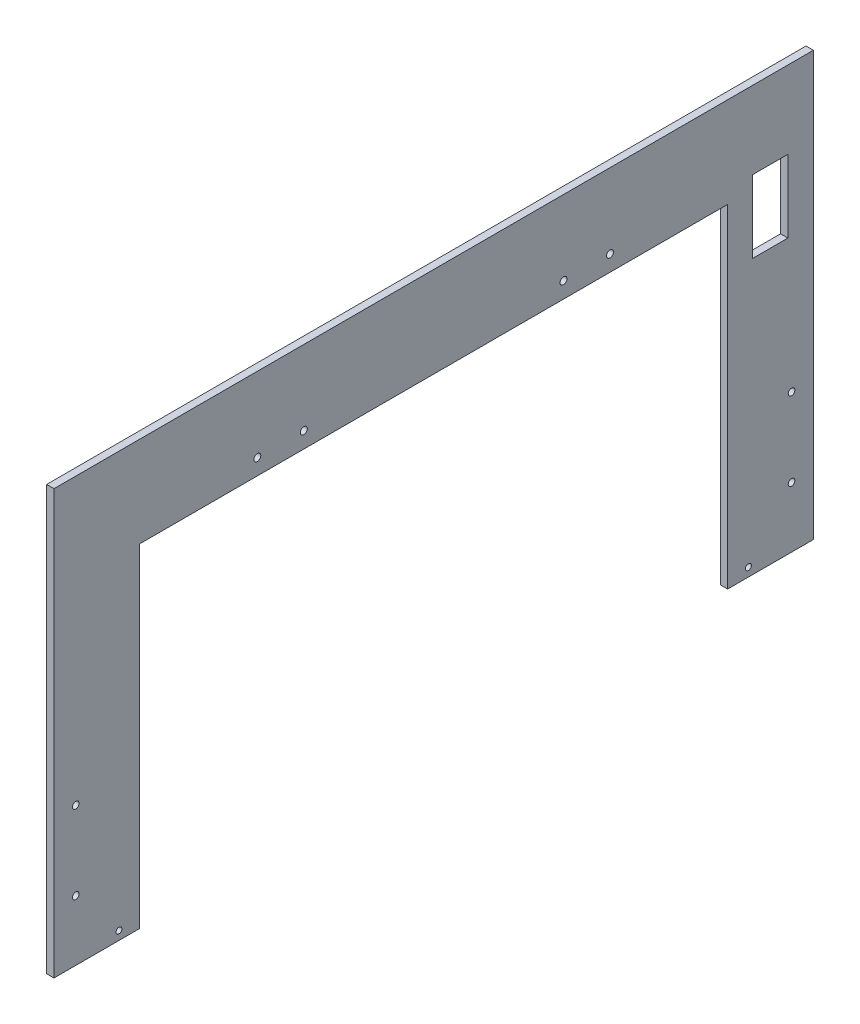
ISO-10303-21;
HEADER;
FILE_DESCRIPTION(('STEP AP214'),'2;1');
FILE_NAME('part.step','',(''),(''),'','','');
FILE_SCHEMA(('AUTOMOTIVE_DESIGN { 1 0 10303 214 1 1 1 1 }'));
ENDSEC;
DATA;
#1=APPLICATION_CONTEXT('core data for automotive mechanical design processes');
#2=APPLICATION_PROTOCOL_DEFINITION('international standard','automotive_design',2000,#1);
#3=PRODUCT_CONTEXT('',#1,'mechanical');
#4=PRODUCT('Part','Part','',(#3));
#5=PRODUCT_RELATED_PRODUCT_CATEGORY('part','',(#4));
#6=PRODUCT_DEFINITION_FORMATION('','',#4);
#7=PRODUCT_DEFINITION_CONTEXT('part definition',#1,'design');
#8=PRODUCT_DEFINITION('design','',#6,#7);
#9=PRODUCT_DEFINITION_SHAPE('','',#8);
#10=(LENGTH_UNIT() NAMED_UNIT(*) SI_UNIT(.MILLI.,.METRE.));
#11=(NAMED_UNIT(*) PLANE_ANGLE_UNIT() SI_UNIT($,.RADIAN.));
#12=(NAMED_UNIT(*) SI_UNIT($,.STERADIAN.) SOLID_ANGLE_UNIT());
#13=UNCERTAINTY_MEASURE_WITH_UNIT(LENGTH_MEASURE(1.E-05),#10,'distance_accuracy_value','');
#14=(GEOMETRIC_REPRESENTATION_CONTEXT(3) GLOBAL_UNCERTAINTY_ASSIGNED_CONTEXT((#13)) GLOBAL_UNIT_ASSIGNED_CONTEXT((#10,
#11,#12)) REPRESENTATION_CONTEXT('',''));
#15=CARTESIAN_POINT('',(0.,0.,0.));
#16=DIRECTION('',(0.,0.,1.));
#17=DIRECTION('',(1.,0.,0.));
#18=AXIS2_PLACEMENT_3D('',#15,#16,#17);
#19=CARTESIAN_POINT('',(4.7625,-137.31875,246.0625));
#20=DIRECTION('',(0.,1.,0.));
#21=DIRECTION('',(0.,0.,1.));
#22=AXIS2_PLACEMENT_3D('',#19,#20,#21);
#23=PLANE('',#22);
#24=DIRECTION('',(0.,0.,-1.));
#25=VECTOR('',#24,1.);
#26=CARTESIAN_POINT('',(0.,-137.31875,246.0625));
#27=LINE('',#26,#25);
#28=CARTESIAN_POINT('',(0.,-137.31875,246.0625));
#29=VERTEX_POINT('',#28);
#30=CARTESIAN_POINT('',(0.,-137.31875,190.5));
#31=VERTEX_POINT('',#30);
#32=EDGE_CURVE('E234',#29,#31,#27,.T.);
#33=ORIENTED_EDGE('',*,*,#32,.T.);
#34=DIRECTION('',(1.,0.,0.));
#35=VECTOR('',#34,1.);
#36=CARTESIAN_POINT('',(0.,-137.31875,190.5));
#37=LINE('',#36,#35);
#38=CARTESIAN_POINT('',(4.7625,-137.31875,190.5));
#39=VERTEX_POINT('',#38);
#40=EDGE_CURVE('E194',#31,#39,#37,.T.);
#41=ORIENTED_EDGE('',*,*,#40,.T.);
#42=DIRECTION('',(0.,0.,-1.));
#43=VECTOR('',#42,1.);
#44=CARTESIAN_POINT('',(4.7625,-137.31875,246.0625));
#45=LINE('',#44,#43);
#46=CARTESIAN_POINT('',(4.7625,-137.31875,246.0625));
#47=VERTEX_POINT('',#46);
#48=EDGE_CURVE('E239',#47,#39,#45,.T.);
#49=ORIENTED_EDGE('',*,*,#48,.F.);
#50=DIRECTION('',(-1.,0.,0.));
#51=VECTOR('',#50,1.);
#52=CARTESIAN_POINT('',(4.7625,-137.31875,246.0625));
#53=LINE('',#52,#51);
#54=EDGE_CURVE('E254',#47,#29,#53,.T.);
#55=ORIENTED_EDGE('',*,*,#54,.T.);
#56=EDGE_LOOP('',(#33,#41,#49,#55));
#57=FACE_BOUND('',#56,.T.);
#58=ADVANCED_FACE('F33',(#57),#23,.F.);
#59=CARTESIAN_POINT('',(4.7625,-137.31875,-246.0625));
#60=DIRECTION('',(0.,0.,1.));
#61=DIRECTION('',(1.,0.,0.));
#62=AXIS2_PLACEMENT_3D('',#59,#60,#61);
#63=PLANE('',#62);
#64=DIRECTION('',(0.,1.,0.));
#65=VECTOR('',#64,1.);
#66=CARTESIAN_POINT('',(0.,-137.31875,-246.0625));
#67=LINE('',#66,#65);
#68=CARTESIAN_POINT('',(0.,-137.31875,-246.0625));
#69=VERTEX_POINT('',#68);
#70=CARTESIAN_POINT('',(0.,137.31875,-246.0625));
#71=VERTEX_POINT('',#70);
#72=EDGE_CURVE('E229',#69,#71,#67,.T.);
#73=ORIENTED_EDGE('',*,*,#72,.T.);
#74=DIRECTION('',(-1.,0.,0.));
#75=VECTOR('',#74,1.);
#76=CARTESIAN_POINT('',(4.7625,137.31875,-246.0625));
#77=LINE('',#76,#75);
#78=CARTESIAN_POINT('',(4.7625,137.31875,-246.0625));
#79=VERTEX_POINT('',#78);
#80=EDGE_CURVE('E260',#79,#71,#77,.T.);
#81=ORIENTED_EDGE('',*,*,#80,.F.);
#82=DIRECTION('',(0.,1.,0.));
#83=VECTOR('',#82,1.);
#84=CARTESIAN_POINT('',(4.7625,-137.31875,-246.0625));
#85=LINE('',#84,#83);
#86=CARTESIAN_POINT('',(4.7625,-137.31875,-246.0625));
#87=VERTEX_POINT('',#86);
#88=EDGE_CURVE('E230',#87,#79,#85,.T.);
#89=ORIENTED_EDGE('',*,*,#88,.F.);
#90=DIRECTION('',(-1.,0.,0.));
#91=VECTOR('',#90,1.);
#92=CARTESIAN_POINT('',(4.7625,-137.31875,-246.0625));
#93=LINE('',#92,#91);
#94=EDGE_CURVE('E242',#87,#69,#93,.T.);
#95=ORIENTED_EDGE('',*,*,#94,.T.);
#96=EDGE_LOOP('',(#73,#81,#89,#95));
#97=FACE_BOUND('',#96,.T.);
#98=ADVANCED_FACE('F35',(#97),#63,.F.);
#99=CARTESIAN_POINT('',(4.7625,137.31875,246.0625));
#100=DIRECTION('',(0.,-1.,0.));
#101=DIRECTION('',(0.,0.,-1.));
#102=AXIS2_PLACEMENT_3D('',#99,#100,#101);
#103=PLANE('',#102);
#104=DIRECTION('',(0.,0.,1.));
#105=VECTOR('',#104,1.);
#106=CARTESIAN_POINT('',(0.,137.31875,246.0625));
#107=LINE('',#106,#105);
#108=CARTESIAN_POINT('',(0.,137.31875,246.0625));
#109=VERTEX_POINT('',#108);
#110=EDGE_CURVE('E245',#71,#109,#107,.T.);
#111=ORIENTED_EDGE('',*,*,#110,.T.);
#112=DIRECTION('',(-1.,0.,0.));
#113=VECTOR('',#112,1.);
#114=CARTESIAN_POINT('',(4.7625,137.31875,246.0625));
#115=LINE('',#114,#113);
#116=CARTESIAN_POINT('',(4.7625,137.31875,246.0625));
#117=VERTEX_POINT('',#116);
#118=EDGE_CURVE('E257',#117,#109,#115,.T.);
#119=ORIENTED_EDGE('',*,*,#118,.F.);
#120=DIRECTION('',(0.,0.,1.));
#121=VECTOR('',#120,1.);
#122=CARTESIAN_POINT('',(4.7625,137.31875,246.0625));
#123=LINE('',#122,#121);
#124=EDGE_CURVE('E233',#79,#117,#123,.T.);
#125=ORIENTED_EDGE('',*,*,#124,.F.);
#126=ORIENTED_EDGE('',*,*,#80,.T.);
#127=EDGE_LOOP('',(#111,#119,#125,#126));
#128=FACE_BOUND('',#127,.T.);
#129=ADVANCED_FACE('F299',(#128),#103,.F.);
#130=CARTESIAN_POINT('',(4.7625,-137.31875,246.0625));
#131=DIRECTION('',(0.,0.,-1.));
#132=DIRECTION('',(-1.,0.,0.));
#133=AXIS2_PLACEMENT_3D('',#130,#131,#132);
#134=PLANE('',#133);
#135=DIRECTION('',(0.,-1.,0.));
#136=VECTOR('',#135,1.);
#137=CARTESIAN_POINT('',(0.,-137.31875,246.0625));
#138=LINE('',#137,#136);
#139=EDGE_CURVE('E247',#109,#29,#138,.T.);
#140=ORIENTED_EDGE('',*,*,#139,.T.);
#141=ORIENTED_EDGE('',*,*,#54,.F.);
#142=DIRECTION('',(0.,-1.,0.));
#143=VECTOR('',#142,1.);
#144=CARTESIAN_POINT('',(4.7625,-137.31875,246.0625));
#145=LINE('',#144,#143);
#146=EDGE_CURVE('E236',#117,#47,#145,.T.);
#147=ORIENTED_EDGE('',*,*,#146,.F.);
#148=ORIENTED_EDGE('',*,*,#118,.T.);
#149=EDGE_LOOP('',(#140,#141,#147,#148));
#150=FACE_BOUND('',#149,.T.);
#151=ADVANCED_FACE('F304',(#150),#134,.F.);
#152=CARTESIAN_POINT('',(4.7625,-137.31875,-190.5));
#153=VERTEX_POINT('',#152);
#154=EDGE_CURVE('E238',#153,#87,#45,.T.);
#155=ORIENTED_EDGE('',*,*,#154,.F.);
#156=DIRECTION('',(1.,0.,0.));
#157=VECTOR('',#156,1.);
#158=CARTESIAN_POINT('',(0.,-137.31875,-190.5));
#159=LINE('',#158,#157);
#160=CARTESIAN_POINT('',(0.,-137.31875,-190.5));
#161=VERTEX_POINT('',#160);
#162=EDGE_CURVE('E206',#161,#153,#159,.T.);
#163=ORIENTED_EDGE('',*,*,#162,.F.);
#164=EDGE_CURVE('E249',#161,#69,#27,.T.);
#165=ORIENTED_EDGE('',*,*,#164,.T.);
#166=ORIENTED_EDGE('',*,*,#94,.F.);
#167=EDGE_LOOP('',(#155,#163,#165,#166));
#168=FACE_BOUND('',#167,.T.);
#169=ADVANCED_FACE('F295',(#168),#23,.F.);
#170=CARTESIAN_POINT('',(4.7625,0.,0.));
#171=DIRECTION('',(-1.,0.,0.));
#172=DIRECTION('',(0.,0.,1.));
#173=AXIS2_PLACEMENT_3D('',#170,#171,#172);
#174=PLANE('',#173);
#175=DIRECTION('',(0.,0.,1.));
#176=VECTOR('',#175,1.);
#177=CARTESIAN_POINT('',(4.7625,87.15375,-206.6925));
#178=LINE('',#177,#176);
#179=CARTESIAN_POINT('',(4.7625,87.15375,-229.5525));
#180=VERTEX_POINT('',#179);
#181=CARTESIAN_POINT('',(4.7625,87.15375,-206.6925));
#182=VERTEX_POINT('',#181);
#183=EDGE_CURVE('E133',#180,#182,#178,.T.);
#184=ORIENTED_EDGE('',*,*,#183,.F.);
#185=DIRECTION('',(0.,1.,0.));
#186=VECTOR('',#185,1.);
#187=CARTESIAN_POINT('',(4.7625,87.15375,-229.5525));
#188=LINE('',#187,#186);
#189=CARTESIAN_POINT('',(4.7625,40.16375,-229.5525));
#190=VERTEX_POINT('',#189);
#191=EDGE_CURVE('E48',#190,#180,#188,.T.);
#192=ORIENTED_EDGE('',*,*,#191,.F.);
#193=DIRECTION('',(0.,0.,-1.));
#194=VECTOR('',#193,1.);
#195=CARTESIAN_POINT('',(4.7625,40.16375,-206.6925));
#196=LINE('',#195,#194);
#197=CARTESIAN_POINT('',(4.7625,40.16375,-206.6925));
#198=VERTEX_POINT('',#197);
#199=EDGE_CURVE('E140',#198,#190,#196,.T.);
#200=ORIENTED_EDGE('',*,*,#199,.F.);
#201=DIRECTION('',(0.,-1.,0.));
#202=VECTOR('',#201,1.);
#203=CARTESIAN_POINT('',(4.7625,87.15375,-206.6925));
#204=LINE('',#203,#202);
#205=EDGE_CURVE('E124',#182,#198,#204,.T.);
#206=ORIENTED_EDGE('',*,*,#205,.F.);
#207=EDGE_LOOP('',(#184,#192,#200,#206));
#208=FACE_BOUND('',#207,.T.);
#209=CARTESIAN_POINT('',(4.7625,-131.73075,203.97089));
#210=DIRECTION('',(1.,0.,0.));
#211=DIRECTION('',(0.,0.,-1.));
#212=AXIS2_PLACEMENT_3D('',#209,#210,#211);
#213=CIRCLE('',#212,1.89865);
#214=CARTESIAN_POINT('',(4.7625,-131.73075,202.07224));
#215=VERTEX_POINT('',#214);
#216=EDGE_CURVE('E147',#215,#215,#213,.T.);
#217=ORIENTED_EDGE('',*,*,#216,.F.);
#218=EDGE_LOOP('',(#217));
#219=FACE_BOUND('',#218,.T.);
#220=CARTESIAN_POINT('',(4.7625,-131.73075,-203.97089));
#221=DIRECTION('',(1.,0.,0.));
#222=DIRECTION('',(0.,0.,-1.));
#223=AXIS2_PLACEMENT_3D('',#220,#221,#222);
#224=CIRCLE('',#223,1.89865);
#225=CARTESIAN_POINT('',(4.7625,-131.73075,-205.86954));
#226=VERTEX_POINT('',#225);
#227=EDGE_CURVE('E155',#226,#226,#224,.T.);
#228=ORIENTED_EDGE('',*,*,#227,.F.);
#229=EDGE_LOOP('',(#228));
#230=FACE_BOUND('',#229,.T.);
#231=CARTESIAN_POINT('',(4.7625,88.9,114.3));
#232=DIRECTION('',(1.,0.,0.));
#233=DIRECTION('',(0.,0.,-1.));
#234=AXIS2_PLACEMENT_3D('',#231,#232,#233);
#235=CIRCLE('',#234,2.24789999999998);
#236=CARTESIAN_POINT('',(4.7625,88.9,112.0521));
#237=VERTEX_POINT('',#236);
#238=EDGE_CURVE('E161',#237,#237,#235,.T.);
#239=ORIENTED_EDGE('',*,*,#238,.F.);
#240=EDGE_LOOP('',(#239));
#241=FACE_BOUND('',#240,.T.);
#242=CARTESIAN_POINT('',(4.7625,88.9,84.1375));
#243=DIRECTION('',(1.,0.,0.));
#244=DIRECTION('',(0.,0.,-1.));
#245=AXIS2_PLACEMENT_3D('',#242,#243,#244);
#246=CIRCLE('',#245,2.24789999999998);
#247=CARTESIAN_POINT('',(4.7625,88.9,81.8896));
#248=VERTEX_POINT('',#247);
#249=EDGE_CURVE('E165',#248,#248,#246,.T.);
#250=ORIENTED_EDGE('',*,*,#249,.F.);
#251=EDGE_LOOP('',(#250));
#252=FACE_BOUND('',#251,.T.);
#253=CARTESIAN_POINT('',(4.7625,88.9,-84.1375));
#254=DIRECTION('',(1.,0.,0.));
#255=DIRECTION('',(0.,0.,-1.));
#256=AXIS2_PLACEMENT_3D('',#253,#254,#255);
#257=CIRCLE('',#256,2.24789999999998);
#258=CARTESIAN_POINT('',(4.7625,88.9,-86.3854));
#259=VERTEX_POINT('',#258);
#260=EDGE_CURVE('E171',#259,#259,#257,.T.);
#261=ORIENTED_EDGE('',*,*,#260,.F.);
#262=EDGE_LOOP('',(#261));
#263=FACE_BOUND('',#262,.T.);
#264=CARTESIAN_POINT('',(4.7625,88.9,-114.3));
#265=DIRECTION('',(1.,0.,0.));
#266=DIRECTION('',(0.,0.,-1.));
#267=AXIS2_PLACEMENT_3D('',#264,#265,#266);
#268=CIRCLE('',#267,2.24789999999998);
#269=CARTESIAN_POINT('',(4.7625,88.9,-116.5479));
#270=VERTEX_POINT('',#269);
#271=EDGE_CURVE('E177',#270,#270,#268,.T.);
#272=ORIENTED_EDGE('',*,*,#271,.F.);
#273=EDGE_LOOP('',(#272));
#274=FACE_BOUND('',#273,.T.);
#275=CARTESIAN_POINT('',(4.7625,-98.20275,231.93375));
#276=DIRECTION('',(1.,0.,0.));
#277=DIRECTION('',(0.,0.,-1.));
#278=AXIS2_PLACEMENT_3D('',#275,#276,#277);
#279=CIRCLE('',#278,2.15264999999999);
#280=CARTESIAN_POINT('',(4.7625,-98.20275,229.7811));
#281=VERTEX_POINT('',#280);
#282=EDGE_CURVE('E203',#281,#281,#279,.T.);
#283=ORIENTED_EDGE('',*,*,#282,.F.);
#284=EDGE_LOOP('',(#283));
#285=FACE_BOUND('',#284,.T.);
#286=CARTESIAN_POINT('',(4.7625,-47.40275,231.93375));
#287=DIRECTION('',(1.,0.,0.));
#288=DIRECTION('',(0.,0.,-1.));
#289=AXIS2_PLACEMENT_3D('',#286,#287,#288);
#290=CIRCLE('',#289,2.15264999999999);
#291=CARTESIAN_POINT('',(4.7625,-47.40275,229.7811));
#292=VERTEX_POINT('',#291);
#293=EDGE_CURVE('E213',#292,#292,#290,.T.);
#294=ORIENTED_EDGE('',*,*,#293,.F.);
#295=EDGE_LOOP('',(#294));
#296=FACE_BOUND('',#295,.T.);
#297=CARTESIAN_POINT('',(4.7625,-47.40275,-231.93375));
#298=DIRECTION('',(1.,0.,0.));
#299=DIRECTION('',(0.,0.,-1.));
#300=AXIS2_PLACEMENT_3D('',#297,#298,#299);
#301=CIRCLE('',#300,2.15264999999999);
#302=CARTESIAN_POINT('',(4.7625,-47.40275,-234.0864));
#303=VERTEX_POINT('',#302);
#304=EDGE_CURVE('E219',#303,#303,#301,.T.);
#305=ORIENTED_EDGE('',*,*,#304,.F.);
#306=EDGE_LOOP('',(#305));
#307=FACE_BOUND('',#306,.T.);
#308=CARTESIAN_POINT('',(4.7625,-98.20275,-231.93375));
#309=DIRECTION('',(1.,0.,0.));
#310=DIRECTION('',(0.,0.,-1.));
#311=AXIS2_PLACEMENT_3D('',#308,#309,#310);
#312=CIRCLE('',#311,2.15264999999999);
#313=CARTESIAN_POINT('',(4.7625,-98.20275,-234.0864));
#314=VERTEX_POINT('',#313);
#315=EDGE_CURVE('E223',#314,#314,#312,.T.);
#316=ORIENTED_EDGE('',*,*,#315,.F.);
#317=EDGE_LOOP('',(#316));
#318=FACE_BOUND('',#317,.T.);
#319=ORIENTED_EDGE('',*,*,#48,.T.);
#320=DIRECTION('',(0.,-1.,0.));
#321=VECTOR('',#320,1.);
#322=CARTESIAN_POINT('',(4.7625,-137.31875,190.5));
#323=LINE('',#322,#321);
#324=CARTESIAN_POINT('',(4.7625,78.58125,190.5));
#325=VERTEX_POINT('',#324);
#326=EDGE_CURVE('E183',#325,#39,#323,.T.);
#327=ORIENTED_EDGE('',*,*,#326,.F.);
#328=DIRECTION('',(0.,0.,1.));
#329=VECTOR('',#328,1.);
#330=CARTESIAN_POINT('',(4.7625,78.58125,190.5));
#331=LINE('',#330,#329);
#332=CARTESIAN_POINT('',(4.7625,78.58125,-190.5));
#333=VERTEX_POINT('',#332);
#334=EDGE_CURVE('E188',#333,#325,#331,.T.);
#335=ORIENTED_EDGE('',*,*,#334,.F.);
#336=DIRECTION('',(0.,1.,0.));
#337=VECTOR('',#336,1.);
#338=CARTESIAN_POINT('',(4.7625,-137.31875,-190.5));
#339=LINE('',#338,#337);
#340=EDGE_CURVE('E196',#153,#333,#339,.T.);
#341=ORIENTED_EDGE('',*,*,#340,.F.);
#342=ORIENTED_EDGE('',*,*,#154,.T.);
#343=ORIENTED_EDGE('',*,*,#88,.T.);
#344=ORIENTED_EDGE('',*,*,#124,.T.);
#345=ORIENTED_EDGE('',*,*,#146,.T.);
#346=EDGE_LOOP('',(#319,#327,#335,#341,#342,#343,#344,#345));
#347=FACE_BOUND('',#346,.T.);
#348=ADVANCED_FACE('F137',(#208,#219,#230,#241,#252,#263,#274,#285,#296,#307,#318,#347),#174,.F.);
#349=CARTESIAN_POINT('',(0.,0.,0.));
#350=DIRECTION('',(-1.,0.,0.));
#351=DIRECTION('',(0.,0.,1.));
#352=AXIS2_PLACEMENT_3D('',#349,#350,#351);
#353=PLANE('',#352);
#354=DIRECTION('',(0.,-1.,0.));
#355=VECTOR('',#354,1.);
#356=CARTESIAN_POINT('',(0.,0.,-229.5525));
#357=LINE('',#356,#355);
#358=CARTESIAN_POINT('',(0.,87.15375,-229.5525));
#359=VERTEX_POINT('',#358);
#360=CARTESIAN_POINT('',(0.,40.16375,-229.5525));
#361=VERTEX_POINT('',#360);
#362=EDGE_CURVE('E11',#359,#361,#357,.T.);
#363=ORIENTED_EDGE('',*,*,#362,.F.);
#364=DIRECTION('',(0.,0.,-1.));
#365=VECTOR('',#364,1.);
#366=CARTESIAN_POINT('',(0.,87.15375,0.));
#367=LINE('',#366,#365);
#368=CARTESIAN_POINT('',(0.,87.15375,-206.6925));
#369=VERTEX_POINT('',#368);
#370=EDGE_CURVE('E263',#369,#359,#367,.T.);
#371=ORIENTED_EDGE('',*,*,#370,.F.);
#372=DIRECTION('',(0.,1.,0.));
#373=VECTOR('',#372,1.);
#374=CARTESIAN_POINT('',(0.,0.,-206.6925));
#375=LINE('',#374,#373);
#376=CARTESIAN_POINT('',(0.,40.16375,-206.6925));
#377=VERTEX_POINT('',#376);
#378=EDGE_CURVE('E127',#377,#369,#375,.T.);
#379=ORIENTED_EDGE('',*,*,#378,.F.);
#380=DIRECTION('',(0.,0.,1.));
#381=VECTOR('',#380,1.);
#382=CARTESIAN_POINT('',(0.,40.16375,0.));
#383=LINE('',#382,#381);
#384=EDGE_CURVE('E41',#361,#377,#383,.T.);
#385=ORIENTED_EDGE('',*,*,#384,.F.);
#386=EDGE_LOOP('',(#363,#371,#379,#385));
#387=FACE_BOUND('',#386,.T.);
#388=CARTESIAN_POINT('',(0.,-131.73075,203.97089));
#389=DIRECTION('',(-1.,0.,0.));
#390=DIRECTION('',(0.,0.,1.));
#391=AXIS2_PLACEMENT_3D('',#388,#389,#390);
#392=CIRCLE('',#391,1.89864999999999);
#393=CARTESIAN_POINT('',(0.,-131.73075,205.86954));
#394=VERTEX_POINT('',#393);
#395=EDGE_CURVE('E152',#394,#394,#392,.T.);
#396=ORIENTED_EDGE('',*,*,#395,.F.);
#397=EDGE_LOOP('',(#396));
#398=FACE_BOUND('',#397,.T.);
#399=CARTESIAN_POINT('',(0.,-131.73075,-203.97089));
#400=DIRECTION('',(-1.,0.,0.));
#401=DIRECTION('',(0.,0.,1.));
#402=AXIS2_PLACEMENT_3D('',#399,#400,#401);
#403=CIRCLE('',#402,1.89864999999999);
#404=CARTESIAN_POINT('',(0.,-131.73075,-202.07224));
#405=VERTEX_POINT('',#404);
#406=EDGE_CURVE('E158',#405,#405,#403,.T.);
#407=ORIENTED_EDGE('',*,*,#406,.F.);
#408=EDGE_LOOP('',(#407));
#409=FACE_BOUND('',#408,.T.);
#410=CARTESIAN_POINT('',(0.,88.9,114.3));
#411=DIRECTION('',(-1.,0.,0.));
#412=DIRECTION('',(0.,0.,1.));
#413=AXIS2_PLACEMENT_3D('',#410,#411,#412);
#414=CIRCLE('',#413,2.24789999999998);
#415=CARTESIAN_POINT('',(0.,88.9,116.5479));
#416=VERTEX_POINT('',#415);
#417=EDGE_CURVE('E164',#416,#416,#414,.T.);
#418=ORIENTED_EDGE('',*,*,#417,.F.);
#419=EDGE_LOOP('',(#418));
#420=FACE_BOUND('',#419,.T.);
#421=CARTESIAN_POINT('',(0.,88.9,84.1375));
#422=DIRECTION('',(-1.,0.,0.));
#423=DIRECTION('',(0.,0.,1.));
#424=AXIS2_PLACEMENT_3D('',#421,#422,#423);
#425=CIRCLE('',#424,2.24789999999998);
#426=CARTESIAN_POINT('',(0.,88.9,86.3854));
#427=VERTEX_POINT('',#426);
#428=EDGE_CURVE('E168',#427,#427,#425,.T.);
#429=ORIENTED_EDGE('',*,*,#428,.F.);
#430=EDGE_LOOP('',(#429));
#431=FACE_BOUND('',#430,.T.);
#432=CARTESIAN_POINT('',(0.,88.9,-84.1375));
#433=DIRECTION('',(-1.,0.,0.));
#434=DIRECTION('',(0.,0.,1.));
#435=AXIS2_PLACEMENT_3D('',#432,#433,#434);
#436=CIRCLE('',#435,2.24789999999998);
#437=CARTESIAN_POINT('',(0.,88.9,-81.8896));
#438=VERTEX_POINT('',#437);
#439=EDGE_CURVE('E174',#438,#438,#436,.T.);
#440=ORIENTED_EDGE('',*,*,#439,.F.);
#441=EDGE_LOOP('',(#440));
#442=FACE_BOUND('',#441,.T.);
#443=CARTESIAN_POINT('',(0.,88.9,-114.3));
#444=DIRECTION('',(-1.,0.,0.));
#445=DIRECTION('',(0.,0.,1.));
#446=AXIS2_PLACEMENT_3D('',#443,#444,#445);
#447=CIRCLE('',#446,2.24789999999998);
#448=CARTESIAN_POINT('',(0.,88.9,-112.0521));
#449=VERTEX_POINT('',#448);
#450=EDGE_CURVE('E180',#449,#449,#447,.T.);
#451=ORIENTED_EDGE('',*,*,#450,.F.);
#452=EDGE_LOOP('',(#451));
#453=FACE_BOUND('',#452,.T.);
#454=DIRECTION('',(0.,-1.,0.));
#455=VECTOR('',#454,1.);
#456=CARTESIAN_POINT('',(0.,-137.31875,190.5));
#457=LINE('',#456,#455);
#458=CARTESIAN_POINT('',(0.,78.58125,190.5));
#459=VERTEX_POINT('',#458);
#460=EDGE_CURVE('E184',#459,#31,#457,.T.);
#461=ORIENTED_EDGE('',*,*,#460,.T.);
#462=ORIENTED_EDGE('',*,*,#32,.F.);
#463=ORIENTED_EDGE('',*,*,#139,.F.);
#464=ORIENTED_EDGE('',*,*,#110,.F.);
#465=ORIENTED_EDGE('',*,*,#72,.F.);
#466=ORIENTED_EDGE('',*,*,#164,.F.);
#467=DIRECTION('',(0.,1.,0.));
#468=VECTOR('',#467,1.);
#469=CARTESIAN_POINT('',(0.,-137.31875,-190.5));
#470=LINE('',#469,#468);
#471=CARTESIAN_POINT('',(0.,78.58125,-190.5));
#472=VERTEX_POINT('',#471);
#473=EDGE_CURVE('E187',#161,#472,#470,.T.);
#474=ORIENTED_EDGE('',*,*,#473,.T.);
#475=DIRECTION('',(0.,0.,1.));
#476=VECTOR('',#475,1.);
#477=CARTESIAN_POINT('',(0.,78.58125,190.5));
#478=LINE('',#477,#476);
#479=EDGE_CURVE('E191',#472,#459,#478,.T.);
#480=ORIENTED_EDGE('',*,*,#479,.T.);
#481=EDGE_LOOP('',(#461,#462,#463,#464,#465,#466,#474,#480));
#482=FACE_BOUND('',#481,.T.);
#483=CARTESIAN_POINT('',(0.,-98.20275,231.93375));
#484=DIRECTION('',(-1.,0.,0.));
#485=DIRECTION('',(0.,0.,1.));
#486=AXIS2_PLACEMENT_3D('',#483,#484,#485);
#487=CIRCLE('',#486,2.15264999999999);
#488=CARTESIAN_POINT('',(0.,-98.20275,234.0864));
#489=VERTEX_POINT('',#488);
#490=EDGE_CURVE('E212',#489,#489,#487,.T.);
#491=ORIENTED_EDGE('',*,*,#490,.F.);
#492=EDGE_LOOP('',(#491));
#493=FACE_BOUND('',#492,.T.);
#494=CARTESIAN_POINT('',(0.,-47.40275,231.93375));
#495=DIRECTION('',(-1.,0.,0.));
#496=DIRECTION('',(0.,0.,1.));
#497=AXIS2_PLACEMENT_3D('',#494,#495,#496);
#498=CIRCLE('',#497,2.15264999999999);
#499=CARTESIAN_POINT('',(0.,-47.40275,234.0864));
#500=VERTEX_POINT('',#499);
#501=EDGE_CURVE('E216',#500,#500,#498,.T.);
#502=ORIENTED_EDGE('',*,*,#501,.F.);
#503=EDGE_LOOP('',(#502));
#504=FACE_BOUND('',#503,.T.);
#505=CARTESIAN_POINT('',(0.,-47.40275,-231.93375));
#506=DIRECTION('',(-1.,0.,0.));
#507=DIRECTION('',(0.,0.,1.));
#508=AXIS2_PLACEMENT_3D('',#505,#506,#507);
#509=CIRCLE('',#508,2.15264999999999);
#510=CARTESIAN_POINT('',(0.,-47.40275,-229.7811));
#511=VERTEX_POINT('',#510);
#512=EDGE_CURVE('E222',#511,#511,#509,.T.);
#513=ORIENTED_EDGE('',*,*,#512,.F.);
#514=EDGE_LOOP('',(#513));
#515=FACE_BOUND('',#514,.T.);
#516=CARTESIAN_POINT('',(0.,-98.20275,-231.93375));
#517=DIRECTION('',(-1.,0.,0.));
#518=DIRECTION('',(0.,0.,1.));
#519=AXIS2_PLACEMENT_3D('',#516,#517,#518);
#520=CIRCLE('',#519,2.15264999999999);
#521=CARTESIAN_POINT('',(0.,-98.20275,-229.7811));
#522=VERTEX_POINT('',#521);
#523=EDGE_CURVE('E226',#522,#522,#520,.T.);
#524=ORIENTED_EDGE('',*,*,#523,.F.);
#525=EDGE_LOOP('',(#524));
#526=FACE_BOUND('',#525,.T.);
#527=ADVANCED_FACE('F277',(#387,#398,#409,#420,#431,#442,#453,#482,#493,#504,#515,#526),#353,.T.);
#528=CARTESIAN_POINT('',(4.7625,-98.20275,-231.93375));
#529=DIRECTION('',(1.,0.,0.));
#530=DIRECTION('',(0.,0.,-1.));
#531=AXIS2_PLACEMENT_3D('',#528,#529,#530);
#532=CYLINDRICAL_SURFACE('',#531,2.15264999999999);
#533=ORIENTED_EDGE('',*,*,#523,.T.);
#534=EDGE_LOOP('',(#533));
#535=FACE_BOUND('',#534,.T.);
#536=ORIENTED_EDGE('',*,*,#315,.T.);
#537=EDGE_LOOP('',(#536));
#538=FACE_BOUND('',#537,.T.);
#539=ADVANCED_FACE('F363',(#535,#538),#532,.F.);
#540=CARTESIAN_POINT('',(4.7625,-47.40275,-231.93375));
#541=DIRECTION('',(1.,0.,0.));
#542=DIRECTION('',(0.,0.,-1.));
#543=AXIS2_PLACEMENT_3D('',#540,#541,#542);
#544=CYLINDRICAL_SURFACE('',#543,2.15264999999999);
#545=ORIENTED_EDGE('',*,*,#512,.T.);
#546=EDGE_LOOP('',(#545));
#547=FACE_BOUND('',#546,.T.);
#548=ORIENTED_EDGE('',*,*,#304,.T.);
#549=EDGE_LOOP('',(#548));
#550=FACE_BOUND('',#549,.T.);
#551=ADVANCED_FACE('F359',(#547,#550),#544,.F.);
#552=CARTESIAN_POINT('',(4.7625,-47.40275,231.93375));
#553=DIRECTION('',(1.,0.,0.));
#554=DIRECTION('',(0.,0.,-1.));
#555=AXIS2_PLACEMENT_3D('',#552,#553,#554);
#556=CYLINDRICAL_SURFACE('',#555,2.15264999999999);
#557=ORIENTED_EDGE('',*,*,#501,.T.);
#558=EDGE_LOOP('',(#557));
#559=FACE_BOUND('',#558,.T.);
#560=ORIENTED_EDGE('',*,*,#293,.T.);
#561=EDGE_LOOP('',(#560));
#562=FACE_BOUND('',#561,.T.);
#563=ADVANCED_FACE('F355',(#559,#562),#556,.F.);
#564=CARTESIAN_POINT('',(4.7625,-98.20275,231.93375));
#565=DIRECTION('',(1.,0.,0.));
#566=DIRECTION('',(0.,0.,-1.));
#567=AXIS2_PLACEMENT_3D('',#564,#565,#566);
#568=CYLINDRICAL_SURFACE('',#567,2.15264999999999);
#569=ORIENTED_EDGE('',*,*,#490,.T.);
#570=EDGE_LOOP('',(#569));
#571=FACE_BOUND('',#570,.T.);
#572=ORIENTED_EDGE('',*,*,#282,.T.);
#573=EDGE_LOOP('',(#572));
#574=FACE_BOUND('',#573,.T.);
#575=ADVANCED_FACE('F348',(#571,#574),#568,.F.);
#576=CARTESIAN_POINT('',(0.,-137.31875,190.5));
#577=DIRECTION('',(0.,0.,1.));
#578=DIRECTION('',(1.,0.,0.));
#579=AXIS2_PLACEMENT_3D('',#576,#577,#578);
#580=PLANE('',#579);
#581=ORIENTED_EDGE('',*,*,#326,.T.);
#582=ORIENTED_EDGE('',*,*,#40,.F.);
#583=ORIENTED_EDGE('',*,*,#460,.F.);
#584=DIRECTION('',(1.,0.,0.));
#585=VECTOR('',#584,1.);
#586=CARTESIAN_POINT('',(0.,78.58125,190.5));
#587=LINE('',#586,#585);
#588=EDGE_CURVE('E201',#459,#325,#587,.T.);
#589=ORIENTED_EDGE('',*,*,#588,.T.);
#590=EDGE_LOOP('',(#581,#582,#583,#589));
#591=FACE_BOUND('',#590,.T.);
#592=ADVANCED_FACE('F337',(#591),#580,.F.);
#593=CARTESIAN_POINT('',(0.,78.58125,190.5));
#594=DIRECTION('',(0.,1.,0.));
#595=DIRECTION('',(0.,0.,1.));
#596=AXIS2_PLACEMENT_3D('',#593,#594,#595);
#597=PLANE('',#596);
#598=ORIENTED_EDGE('',*,*,#334,.T.);
#599=ORIENTED_EDGE('',*,*,#588,.F.);
#600=ORIENTED_EDGE('',*,*,#479,.F.);
#601=DIRECTION('',(1.,0.,0.));
#602=VECTOR('',#601,1.);
#603=CARTESIAN_POINT('',(0.,78.58125,-190.5));
#604=LINE('',#603,#602);
#605=EDGE_CURVE('E204',#472,#333,#604,.T.);
#606=ORIENTED_EDGE('',*,*,#605,.T.);
#607=EDGE_LOOP('',(#598,#599,#600,#606));
#608=FACE_BOUND('',#607,.T.);
#609=ADVANCED_FACE('F339',(#608),#597,.F.);
#610=CARTESIAN_POINT('',(0.,-137.31875,-190.5));
#611=DIRECTION('',(0.,0.,-1.));
#612=DIRECTION('',(-1.,0.,0.));
#613=AXIS2_PLACEMENT_3D('',#610,#611,#612);
#614=PLANE('',#613);
#615=ORIENTED_EDGE('',*,*,#340,.T.);
#616=ORIENTED_EDGE('',*,*,#605,.F.);
#617=ORIENTED_EDGE('',*,*,#473,.F.);
#618=ORIENTED_EDGE('',*,*,#162,.T.);
#619=EDGE_LOOP('',(#615,#616,#617,#618));
#620=FACE_BOUND('',#619,.T.);
#621=ADVANCED_FACE('F324',(#620),#614,.F.);
#622=CARTESIAN_POINT('',(4.7625,88.9,-114.3));
#623=DIRECTION('',(1.,0.,0.));
#624=DIRECTION('',(0.,0.,-1.));
#625=AXIS2_PLACEMENT_3D('',#622,#623,#624);
#626=CYLINDRICAL_SURFACE('',#625,2.24789999999998);
#627=ORIENTED_EDGE('',*,*,#450,.T.);
#628=EDGE_LOOP('',(#627));
#629=FACE_BOUND('',#628,.T.);
#630=ORIENTED_EDGE('',*,*,#271,.T.);
#631=EDGE_LOOP('',(#630));
#632=FACE_BOUND('',#631,.T.);
#633=ADVANCED_FACE('F346',(#629,#632),#626,.F.);
#634=CARTESIAN_POINT('',(4.7625,88.9,-84.1375));
#635=DIRECTION('',(1.,0.,0.));
#636=DIRECTION('',(0.,0.,-1.));
#637=AXIS2_PLACEMENT_3D('',#634,#635,#636);
#638=CYLINDRICAL_SURFACE('',#637,2.24789999999998);
#639=ORIENTED_EDGE('',*,*,#439,.T.);
#640=EDGE_LOOP('',(#639));
#641=FACE_BOUND('',#640,.T.);
#642=ORIENTED_EDGE('',*,*,#260,.T.);
#643=EDGE_LOOP('',(#642));
#644=FACE_BOUND('',#643,.T.);
#645=ADVANCED_FACE('F415',(#641,#644),#638,.F.);
#646=CARTESIAN_POINT('',(4.7625,88.9,84.1375));
#647=DIRECTION('',(1.,0.,0.));
#648=DIRECTION('',(0.,0.,-1.));
#649=AXIS2_PLACEMENT_3D('',#646,#647,#648);
#650=CYLINDRICAL_SURFACE('',#649,2.24789999999998);
#651=ORIENTED_EDGE('',*,*,#428,.T.);
#652=EDGE_LOOP('',(#651));
#653=FACE_BOUND('',#652,.T.);
#654=ORIENTED_EDGE('',*,*,#249,.T.);
#655=EDGE_LOOP('',(#654));
#656=FACE_BOUND('',#655,.T.);
#657=ADVANCED_FACE('F424',(#653,#656),#650,.F.);
#658=CARTESIAN_POINT('',(4.7625,88.9,114.3));
#659=DIRECTION('',(1.,0.,0.));
#660=DIRECTION('',(0.,0.,-1.));
#661=AXIS2_PLACEMENT_3D('',#658,#659,#660);
#662=CYLINDRICAL_SURFACE('',#661,2.24789999999998);
#663=ORIENTED_EDGE('',*,*,#417,.T.);
#664=EDGE_LOOP('',(#663));
#665=FACE_BOUND('',#664,.T.);
#666=ORIENTED_EDGE('',*,*,#238,.T.);
#667=EDGE_LOOP('',(#666));
#668=FACE_BOUND('',#667,.T.);
#669=ADVANCED_FACE('F433',(#665,#668),#662,.F.);
#670=CARTESIAN_POINT('',(4.7625,-131.73075,-203.97089));
#671=DIRECTION('',(1.,0.,0.));
#672=DIRECTION('',(0.,0.,-1.));
#673=AXIS2_PLACEMENT_3D('',#670,#671,#672);
#674=CYLINDRICAL_SURFACE('',#673,1.89864999999999);
#675=ORIENTED_EDGE('',*,*,#406,.T.);
#676=EDGE_LOOP('',(#675));
#677=FACE_BOUND('',#676,.T.);
#678=ORIENTED_EDGE('',*,*,#227,.T.);
#679=EDGE_LOOP('',(#678));
#680=FACE_BOUND('',#679,.T.);
#681=ADVANCED_FACE('F288',(#677,#680),#674,.F.);
#682=CARTESIAN_POINT('',(4.7625,-131.73075,203.97089));
#683=DIRECTION('',(1.,0.,0.));
#684=DIRECTION('',(0.,0.,-1.));
#685=AXIS2_PLACEMENT_3D('',#682,#683,#684);
#686=CYLINDRICAL_SURFACE('',#685,1.89864999999999);
#687=ORIENTED_EDGE('',*,*,#395,.T.);
#688=EDGE_LOOP('',(#687));
#689=FACE_BOUND('',#688,.T.);
#690=ORIENTED_EDGE('',*,*,#216,.T.);
#691=EDGE_LOOP('',(#690));
#692=FACE_BOUND('',#691,.T.);
#693=ADVANCED_FACE('F281',(#689,#692),#686,.F.);
#694=CARTESIAN_POINT('',(-41.9735,87.15375,-229.5525));
#695=DIRECTION('',(0.,0.,-1.));
#696=DIRECTION('',(-1.,0.,0.));
#697=AXIS2_PLACEMENT_3D('',#694,#695,#696);
#698=PLANE('',#697);
#699=ORIENTED_EDGE('',*,*,#362,.T.);
#700=DIRECTION('',(1.,0.,0.));
#701=VECTOR('',#700,1.);
#702=CARTESIAN_POINT('',(-41.9735,40.16375,-229.5525));
#703=LINE('',#702,#701);
#704=EDGE_CURVE('E145',#361,#190,#703,.T.);
#705=ORIENTED_EDGE('',*,*,#704,.T.);
#706=ORIENTED_EDGE('',*,*,#191,.T.);
#707=DIRECTION('',(1.,0.,0.));
#708=VECTOR('',#707,1.);
#709=CARTESIAN_POINT('',(-41.9735,87.15375,-229.5525));
#710=LINE('',#709,#708);
#711=EDGE_CURVE('E130',#359,#180,#710,.T.);
#712=ORIENTED_EDGE('',*,*,#711,.F.);
#713=EDGE_LOOP('',(#699,#705,#706,#712));
#714=FACE_BOUND('',#713,.T.);
#715=ADVANCED_FACE('F279',(#714),#698,.F.);
#716=CARTESIAN_POINT('',(-41.9735,40.16375,-206.6925));
#717=DIRECTION('',(0.,-1.,0.));
#718=DIRECTION('',(0.,0.,-1.));
#719=AXIS2_PLACEMENT_3D('',#716,#717,#718);
#720=PLANE('',#719);
#721=ORIENTED_EDGE('',*,*,#384,.T.);
#722=DIRECTION('',(1.,0.,0.));
#723=VECTOR('',#722,1.);
#724=CARTESIAN_POINT('',(-41.9735,40.16375,-206.6925));
#725=LINE('',#724,#723);
#726=EDGE_CURVE('E129',#377,#198,#725,.T.);
#727=ORIENTED_EDGE('',*,*,#726,.T.);
#728=ORIENTED_EDGE('',*,*,#199,.T.);
#729=ORIENTED_EDGE('',*,*,#704,.F.);
#730=EDGE_LOOP('',(#721,#727,#728,#729));
#731=FACE_BOUND('',#730,.T.);
#732=ADVANCED_FACE('F274',(#731),#720,.F.);
#733=CARTESIAN_POINT('',(-41.9735,87.15375,-206.6925));
#734=DIRECTION('',(0.,0.,1.));
#735=DIRECTION('',(1.,0.,0.));
#736=AXIS2_PLACEMENT_3D('',#733,#734,#735);
#737=PLANE('',#736);
#738=ORIENTED_EDGE('',*,*,#378,.T.);
#739=DIRECTION('',(1.,0.,0.));
#740=VECTOR('',#739,1.);
#741=CARTESIAN_POINT('',(-41.9735,87.15375,-206.6925));
#742=LINE('',#741,#740);
#743=EDGE_CURVE('E56',#369,#182,#742,.T.);
#744=ORIENTED_EDGE('',*,*,#743,.T.);
#745=ORIENTED_EDGE('',*,*,#205,.T.);
#746=ORIENTED_EDGE('',*,*,#726,.F.);
#747=EDGE_LOOP('',(#738,#744,#745,#746));
#748=FACE_BOUND('',#747,.T.);
#749=ADVANCED_FACE('F121',(#748),#737,.F.);
#750=CARTESIAN_POINT('',(-41.9735,87.15375,-206.6925));
#751=DIRECTION('',(0.,1.,0.));
#752=DIRECTION('',(0.,0.,1.));
#753=AXIS2_PLACEMENT_3D('',#750,#751,#752);
#754=PLANE('',#753);
#755=ORIENTED_EDGE('',*,*,#370,.T.);
#756=ORIENTED_EDGE('',*,*,#711,.T.);
#757=ORIENTED_EDGE('',*,*,#183,.T.);
#758=ORIENTED_EDGE('',*,*,#743,.F.);
#759=EDGE_LOOP('',(#755,#756,#757,#758));
#760=FACE_BOUND('',#759,.T.);
#761=ADVANCED_FACE('F134',(#760),#754,.F.);
#762=CLOSED_SHELL('',(#58,#98,#129,#151,#169,#348,#527,#539,#551,#563,#575,#592,#609,#621,#633,
#645,#657,#669,#681,#693,#715,#732,#749,#761));
#763=MANIFOLD_SOLID_BREP('B2',#762);
#764=ADVANCED_BREP_SHAPE_REPRESENTATION('',(#18,#763),#14);
#765=SHAPE_DEFINITION_REPRESENTATION(#9,#764);
ENDSEC;
END-ISO-10303-21;
